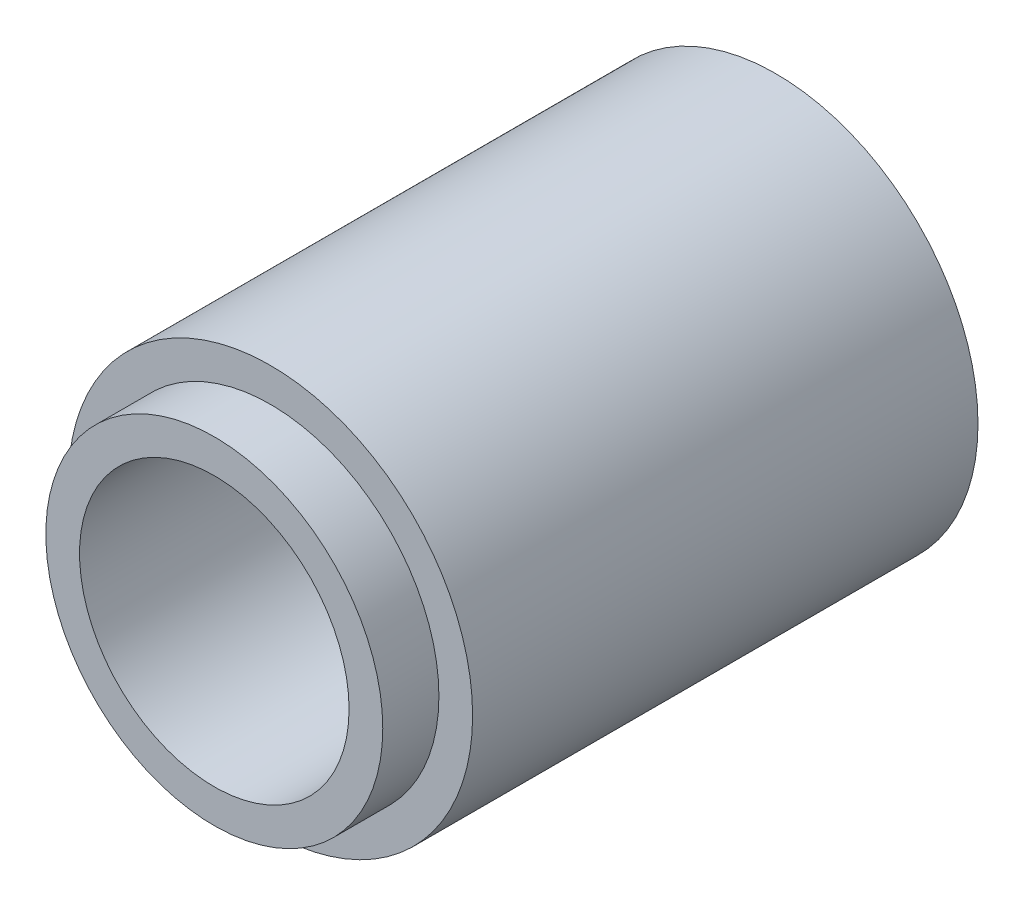
ISO-10303-21;
HEADER;
FILE_DESCRIPTION(('STEP AP214'),'2;1');
FILE_NAME('part.step','',(''),(''),'','','');
FILE_SCHEMA(('AUTOMOTIVE_DESIGN { 1 0 10303 214 1 1 1 1 }'));
ENDSEC;
DATA;
#1=APPLICATION_CONTEXT('core data for automotive mechanical design processes');
#2=APPLICATION_PROTOCOL_DEFINITION('international standard','automotive_design',2000,#1);
#3=PRODUCT_CONTEXT('',#1,'mechanical');
#4=PRODUCT('Part','Part','',(#3));
#5=PRODUCT_RELATED_PRODUCT_CATEGORY('part','',(#4));
#6=PRODUCT_DEFINITION_FORMATION('','',#4);
#7=PRODUCT_DEFINITION_CONTEXT('part definition',#1,'design');
#8=PRODUCT_DEFINITION('design','',#6,#7);
#9=PRODUCT_DEFINITION_SHAPE('','',#8);
#10=(LENGTH_UNIT() NAMED_UNIT(*) SI_UNIT(.MILLI.,.METRE.));
#11=(NAMED_UNIT(*) PLANE_ANGLE_UNIT() SI_UNIT($,.RADIAN.));
#12=(NAMED_UNIT(*) SI_UNIT($,.STERADIAN.) SOLID_ANGLE_UNIT());
#13=UNCERTAINTY_MEASURE_WITH_UNIT(LENGTH_MEASURE(1.E-05),#10,'distance_accuracy_value','');
#14=(GEOMETRIC_REPRESENTATION_CONTEXT(3) GLOBAL_UNCERTAINTY_ASSIGNED_CONTEXT((#13)) GLOBAL_UNIT_ASSIGNED_CONTEXT((#10,
#11,#12)) REPRESENTATION_CONTEXT('',''));
#15=CARTESIAN_POINT('',(0.,0.,0.));
#16=DIRECTION('',(0.,0.,1.));
#17=DIRECTION('',(1.,0.,0.));
#18=AXIS2_PLACEMENT_3D('',#15,#16,#17);
#19=CARTESIAN_POINT('',(0.,0.,3.));
#20=DIRECTION('',(0.,0.,1.));
#21=DIRECTION('',(1.,0.,0.));
#22=AXIS2_PLACEMENT_3D('',#19,#20,#21);
#23=CYLINDRICAL_SURFACE('',#22,6.);
#24=CARTESIAN_POINT('',(0.,0.,25.));
#25=DIRECTION('',(0.,0.,1.));
#26=DIRECTION('',(1.,0.,0.));
#27=AXIS2_PLACEMENT_3D('',#24,#25,#26);
#28=CIRCLE('',#27,6.);
#29=CARTESIAN_POINT('',(6.,0.,25.));
#30=VERTEX_POINT('',#29);
#31=EDGE_CURVE('E17',#30,#30,#28,.T.);
#32=ORIENTED_EDGE('',*,*,#31,.T.);
#33=EDGE_LOOP('',(#32));
#34=FACE_BOUND('',#33,.T.);
#35=CARTESIAN_POINT('',(0.,0.,3.));
#36=DIRECTION('',(0.,0.,1.));
#37=DIRECTION('',(1.,0.,0.));
#38=AXIS2_PLACEMENT_3D('',#35,#36,#37);
#39=CIRCLE('',#38,6.);
#40=CARTESIAN_POINT('',(6.,0.,3.));
#41=VERTEX_POINT('',#40);
#42=EDGE_CURVE('E39',#41,#41,#39,.F.);
#43=ORIENTED_EDGE('',*,*,#42,.T.);
#44=EDGE_LOOP('',(#43));
#45=FACE_BOUND('',#44,.T.);
#46=ADVANCED_FACE('F14',(#34,#45),#23,.F.);
#47=CARTESIAN_POINT('',(7.5,0.,25.));
#48=DIRECTION('',(0.,0.,-1.));
#49=DIRECTION('',(-1.,0.,0.));
#50=AXIS2_PLACEMENT_3D('',#47,#48,#49);
#51=PLANE('',#50);
#52=CARTESIAN_POINT('',(0.,0.,25.));
#53=DIRECTION('',(0.,0.,1.));
#54=DIRECTION('',(1.,0.,0.));
#55=AXIS2_PLACEMENT_3D('',#52,#53,#54);
#56=CIRCLE('',#55,7.5);
#57=CARTESIAN_POINT('',(7.5,0.,25.));
#58=VERTEX_POINT('',#57);
#59=EDGE_CURVE('E37',#58,#58,#56,.F.);
#60=ORIENTED_EDGE('',*,*,#59,.F.);
#61=EDGE_LOOP('',(#60));
#62=FACE_BOUND('',#61,.T.);
#63=ORIENTED_EDGE('',*,*,#31,.F.);
#64=EDGE_LOOP('',(#63));
#65=FACE_BOUND('',#64,.T.);
#66=ADVANCED_FACE('F47',(#62,#65),#51,.F.);
#67=CARTESIAN_POINT('',(6.,0.,3.));
#68=DIRECTION('',(0.,0.,-1.));
#69=DIRECTION('',(-1.,0.,0.));
#70=AXIS2_PLACEMENT_3D('',#67,#68,#69);
#71=PLANE('',#70);
#72=ORIENTED_EDGE('',*,*,#42,.F.);
#73=EDGE_LOOP('',(#72));
#74=FACE_BOUND('',#73,.T.);
#75=CARTESIAN_POINT('',(0.,0.,3.));
#76=DIRECTION('',(0.,0.,-1.));
#77=DIRECTION('',(-1.,0.,0.));
#78=AXIS2_PLACEMENT_3D('',#75,#76,#77);
#79=CIRCLE('',#78,4.);
#80=CARTESIAN_POINT('',(-4.,0.,3.));
#81=VERTEX_POINT('',#80);
#82=EDGE_CURVE('E34',#81,#81,#79,.T.);
#83=ORIENTED_EDGE('',*,*,#82,.T.);
#84=EDGE_LOOP('',(#83));
#85=FACE_BOUND('',#84,.T.);
#86=ADVANCED_FACE('F49',(#74,#85),#71,.F.);
#87=CARTESIAN_POINT('',(0.,0.,3.));
#88=DIRECTION('',(0.,0.,1.));
#89=DIRECTION('',(1.,0.,0.));
#90=AXIS2_PLACEMENT_3D('',#87,#88,#89);
#91=CYLINDRICAL_SURFACE('',#90,7.5);
#92=CARTESIAN_POINT('',(0.,0.,22.5));
#93=DIRECTION('',(0.,0.,1.));
#94=DIRECTION('',(1.,0.,0.));
#95=AXIS2_PLACEMENT_3D('',#92,#93,#94);
#96=CIRCLE('',#95,7.5);
#97=CARTESIAN_POINT('',(7.5,0.,22.5));
#98=VERTEX_POINT('',#97);
#99=EDGE_CURVE('E31',#98,#98,#96,.T.);
#100=ORIENTED_EDGE('',*,*,#99,.T.);
#101=EDGE_LOOP('',(#100));
#102=FACE_BOUND('',#101,.T.);
#103=ORIENTED_EDGE('',*,*,#59,.T.);
#104=EDGE_LOOP('',(#103));
#105=FACE_BOUND('',#104,.T.);
#106=ADVANCED_FACE('F56',(#102,#105),#91,.T.);
#107=CARTESIAN_POINT('',(0.,0.,35.6791255498226));
#108=DIRECTION('',(0.,0.,-1.));
#109=DIRECTION('',(-1.,0.,0.));
#110=AXIS2_PLACEMENT_3D('',#107,#108,#109);
#111=CYLINDRICAL_SURFACE('',#110,4.);
#112=CARTESIAN_POINT('',(0.,0.,0.));
#113=DIRECTION('',(0.,0.,-1.));
#114=DIRECTION('',(-1.,0.,0.));
#115=AXIS2_PLACEMENT_3D('',#112,#113,#114);
#116=CIRCLE('',#115,4.);
#117=CARTESIAN_POINT('',(-4.,0.,0.));
#118=VERTEX_POINT('',#117);
#119=EDGE_CURVE('E26',#118,#118,#116,.T.);
#120=ORIENTED_EDGE('',*,*,#119,.T.);
#121=EDGE_LOOP('',(#120));
#122=FACE_BOUND('',#121,.T.);
#123=ORIENTED_EDGE('',*,*,#82,.F.);
#124=EDGE_LOOP('',(#123));
#125=FACE_BOUND('',#124,.T.);
#126=ADVANCED_FACE('F74',(#122,#125),#111,.F.);
#127=CARTESIAN_POINT('',(9.,0.,22.5));
#128=DIRECTION('',(0.,0.,-1.));
#129=DIRECTION('',(-1.,0.,0.));
#130=AXIS2_PLACEMENT_3D('',#127,#128,#129);
#131=PLANE('',#130);
#132=CARTESIAN_POINT('',(0.,0.,22.5));
#133=DIRECTION('',(0.,0.,1.));
#134=DIRECTION('',(1.,0.,0.));
#135=AXIS2_PLACEMENT_3D('',#132,#133,#134);
#136=CIRCLE('',#135,9.);
#137=CARTESIAN_POINT('',(9.,0.,22.5));
#138=VERTEX_POINT('',#137);
#139=EDGE_CURVE('E21',#138,#138,#136,.F.);
#140=ORIENTED_EDGE('',*,*,#139,.F.);
#141=EDGE_LOOP('',(#140));
#142=FACE_BOUND('',#141,.T.);
#143=ORIENTED_EDGE('',*,*,#99,.F.);
#144=EDGE_LOOP('',(#143));
#145=FACE_BOUND('',#144,.T.);
#146=ADVANCED_FACE('F67',(#142,#145),#131,.F.);
#147=CARTESIAN_POINT('',(0.,0.,0.));
#148=DIRECTION('',(0.,0.,1.));
#149=DIRECTION('',(1.,0.,0.));
#150=AXIS2_PLACEMENT_3D('',#147,#148,#149);
#151=PLANE('',#150);
#152=CARTESIAN_POINT('',(0.,0.,0.));
#153=DIRECTION('',(0.,0.,1.));
#154=DIRECTION('',(1.,0.,0.));
#155=AXIS2_PLACEMENT_3D('',#152,#153,#154);
#156=CIRCLE('',#155,9.);
#157=CARTESIAN_POINT('',(9.,0.,0.));
#158=VERTEX_POINT('',#157);
#159=EDGE_CURVE('E10',#158,#158,#156,.T.);
#160=ORIENTED_EDGE('',*,*,#159,.F.);
#161=EDGE_LOOP('',(#160));
#162=FACE_BOUND('',#161,.T.);
#163=ORIENTED_EDGE('',*,*,#119,.F.);
#164=EDGE_LOOP('',(#163));
#165=FACE_BOUND('',#164,.T.);
#166=ADVANCED_FACE('F62',(#162,#165),#151,.F.);
#167=CARTESIAN_POINT('',(0.,0.,3.));
#168=DIRECTION('',(0.,0.,1.));
#169=DIRECTION('',(1.,0.,0.));
#170=AXIS2_PLACEMENT_3D('',#167,#168,#169);
#171=CYLINDRICAL_SURFACE('',#170,9.);
#172=ORIENTED_EDGE('',*,*,#159,.T.);
#173=EDGE_LOOP('',(#172));
#174=FACE_BOUND('',#173,.T.);
#175=ORIENTED_EDGE('',*,*,#139,.T.);
#176=EDGE_LOOP('',(#175));
#177=FACE_BOUND('',#176,.T.);
#178=ADVANCED_FACE('F60',(#174,#177),#171,.T.);
#179=CLOSED_SHELL('',(#46,#66,#86,#106,#126,#146,#166,#178));
#180=MANIFOLD_SOLID_BREP('B1',#179);
#181=ADVANCED_BREP_SHAPE_REPRESENTATION('',(#18,#180),#14);
#182=SHAPE_DEFINITION_REPRESENTATION(#9,#181);
ENDSEC;
END-ISO-10303-21;
